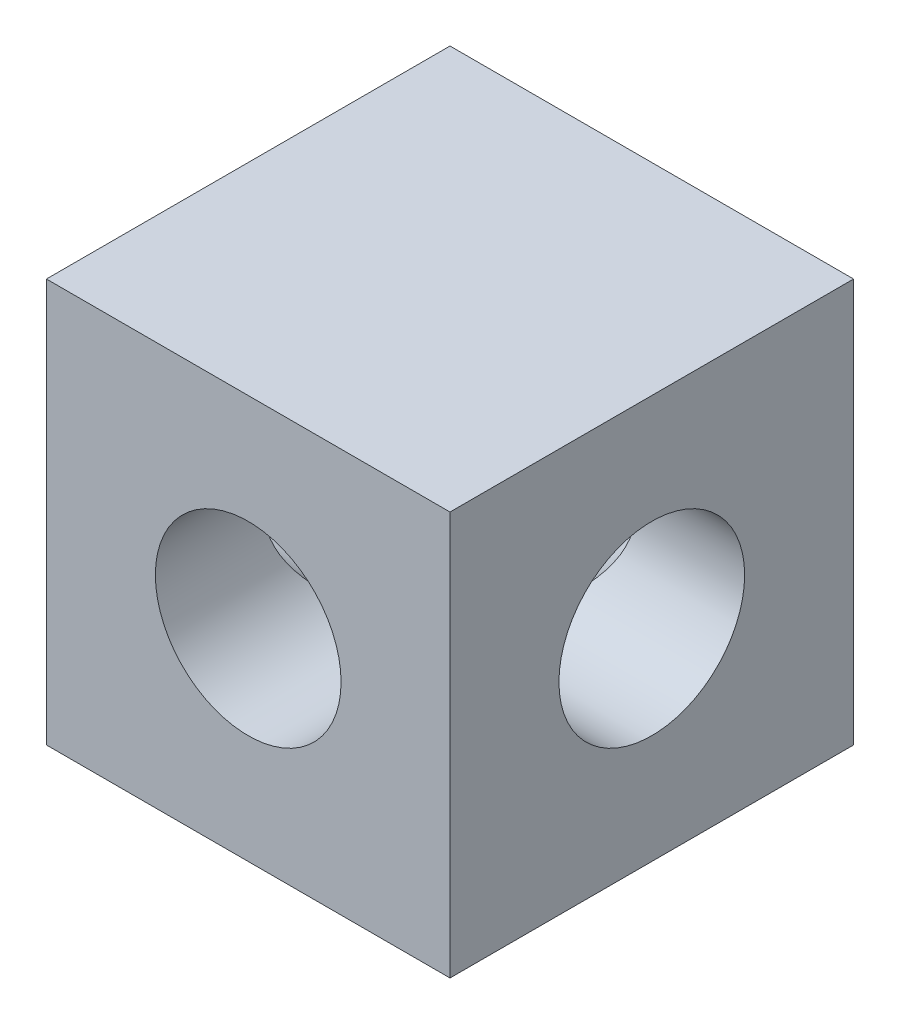
ISO-10303-21;
HEADER;
FILE_DESCRIPTION(('STEP AP214'),'2;1');
FILE_NAME('part.step','',(''),(''),'','','');
FILE_SCHEMA(('AUTOMOTIVE_DESIGN { 1 0 10303 214 1 1 1 1 }'));
ENDSEC;
DATA;
#1=APPLICATION_CONTEXT('core data for automotive mechanical design processes');
#2=APPLICATION_PROTOCOL_DEFINITION('international standard','automotive_design',2000,#1);
#3=PRODUCT_CONTEXT('',#1,'mechanical');
#4=PRODUCT('Part','Part','',(#3));
#5=PRODUCT_RELATED_PRODUCT_CATEGORY('part','',(#4));
#6=PRODUCT_DEFINITION_FORMATION('','',#4);
#7=PRODUCT_DEFINITION_CONTEXT('part definition',#1,'design');
#8=PRODUCT_DEFINITION('design','',#6,#7);
#9=PRODUCT_DEFINITION_SHAPE('','',#8);
#10=(LENGTH_UNIT() NAMED_UNIT(*) SI_UNIT(.MILLI.,.METRE.));
#11=(NAMED_UNIT(*) PLANE_ANGLE_UNIT() SI_UNIT($,.RADIAN.));
#12=(NAMED_UNIT(*) SI_UNIT($,.STERADIAN.) SOLID_ANGLE_UNIT());
#13=UNCERTAINTY_MEASURE_WITH_UNIT(LENGTH_MEASURE(1.E-05),#10,'distance_accuracy_value','');
#14=(GEOMETRIC_REPRESENTATION_CONTEXT(3) GLOBAL_UNCERTAINTY_ASSIGNED_CONTEXT((#13)) GLOBAL_UNIT_ASSIGNED_CONTEXT((#10,
#11,#12)) REPRESENTATION_CONTEXT('',''));
#15=CARTESIAN_POINT('',(0.,0.,0.));
#16=DIRECTION('',(0.,0.,1.));
#17=DIRECTION('',(1.,0.,0.));
#18=AXIS2_PLACEMENT_3D('',#15,#16,#17);
#19=CARTESIAN_POINT('',(0.,10.16,0.060000000000001));
#20=DIRECTION('',(0.,0.,1.));
#21=DIRECTION('',(1.,0.,0.));
#22=AXIS2_PLACEMENT_3D('',#19,#20,#21);
#23=PLANE('',#22);
#24=CARTESIAN_POINT('',(0.,10.16,0.060000000000001));
#25=DIRECTION('',(0.,0.,1.));
#26=DIRECTION('',(1.,0.,0.));
#27=AXIS2_PLACEMENT_3D('',#24,#25,#26);
#28=CIRCLE('',#27,4.675);
#29=CARTESIAN_POINT('',(0.059999999999925,14.8346149574056,0.0600000000000017));
#30=VERTEX_POINT('',#29);
#31=CARTESIAN_POINT('',(-0.0600000000000012,14.8346149574056,0.059999999999993));
#32=VERTEX_POINT('',#31);
#33=EDGE_CURVE('E144',#30,#32,#28,.T.);
#34=ORIENTED_EDGE('',*,*,#33,.T.);
#35=DIRECTION('',(0.,-1.,0.));
#36=VECTOR('',#35,1.);
#37=CARTESIAN_POINT('',(-0.0600000000000012,10.16,0.060000000000001));
#38=LINE('',#37,#36);
#39=CARTESIAN_POINT('',(-0.0600000000000089,5.48538504259442,0.0600000000000008));
#40=VERTEX_POINT('',#39);
#41=EDGE_CURVE('E11',#32,#40,#38,.T.);
#42=ORIENTED_EDGE('',*,*,#41,.T.);
#43=CARTESIAN_POINT('',(0.0600000000000004,5.48538504259442,0.0600000000000252));
#44=VERTEX_POINT('',#43);
#45=EDGE_CURVE('E148',#40,#44,#28,.T.);
#46=ORIENTED_EDGE('',*,*,#45,.T.);
#47=DIRECTION('',(0.,1.,0.));
#48=VECTOR('',#47,1.);
#49=CARTESIAN_POINT('',(0.0600000000000004,10.16,0.060000000000001));
#50=LINE('',#49,#48);
#51=EDGE_CURVE('E41',#44,#30,#50,.T.);
#52=ORIENTED_EDGE('',*,*,#51,.T.);
#53=EDGE_LOOP('',(#34,#42,#46,#52));
#54=FACE_BOUND('',#53,.T.);
#55=ADVANCED_FACE('F33',(#54),#23,.T.);
#56=CARTESIAN_POINT('',(-10.16,20.32,-10.16));
#57=DIRECTION('',(1.,0.,0.));
#58=DIRECTION('',(0.,0.,-1.));
#59=AXIS2_PLACEMENT_3D('',#56,#57,#58);
#60=PLANE('',#59);
#61=CARTESIAN_POINT('',(-10.16,10.16,0.));
#62=DIRECTION('',(-1.,0.,0.));
#63=DIRECTION('',(0.,0.,1.));
#64=AXIS2_PLACEMENT_3D('',#61,#62,#63);
#65=CIRCLE('',#64,4.675);
#66=CARTESIAN_POINT('',(-10.16,10.16,4.67499999999997));
#67=VERTEX_POINT('',#66);
#68=EDGE_CURVE('E128',#67,#67,#65,.T.);
#69=ORIENTED_EDGE('',*,*,#68,.F.);
#70=EDGE_LOOP('',(#69));
#71=FACE_BOUND('',#70,.T.);
#72=DIRECTION('',(0.,0.,1.));
#73=VECTOR('',#72,1.);
#74=CARTESIAN_POINT('',(-10.16,0.,-10.16));
#75=LINE('',#74,#73);
#76=CARTESIAN_POINT('',(-10.16,0.,-10.16));
#77=VERTEX_POINT('',#76);
#78=CARTESIAN_POINT('',(-10.16,0.,10.16));
#79=VERTEX_POINT('',#78);
#80=EDGE_CURVE('E147',#77,#79,#75,.T.);
#81=ORIENTED_EDGE('',*,*,#80,.T.);
#82=DIRECTION('',(0.,-1.,0.));
#83=VECTOR('',#82,1.);
#84=CARTESIAN_POINT('',(-10.16,20.32,10.16));
#85=LINE('',#84,#83);
#86=CARTESIAN_POINT('',(-10.16,20.32,10.16));
#87=VERTEX_POINT('',#86);
#88=EDGE_CURVE('E177',#87,#79,#85,.T.);
#89=ORIENTED_EDGE('',*,*,#88,.F.);
#90=DIRECTION('',(0.,0.,1.));
#91=VECTOR('',#90,1.);
#92=CARTESIAN_POINT('',(-10.16,20.32,-10.16));
#93=LINE('',#92,#91);
#94=CARTESIAN_POINT('',(-10.16,20.32,-10.16));
#95=VERTEX_POINT('',#94);
#96=EDGE_CURVE('E151',#95,#87,#93,.T.);
#97=ORIENTED_EDGE('',*,*,#96,.F.);
#98=DIRECTION('',(0.,-1.,0.));
#99=VECTOR('',#98,1.);
#100=CARTESIAN_POINT('',(-10.16,20.32,-10.16));
#101=LINE('',#100,#99);
#102=EDGE_CURVE('E161',#95,#77,#101,.T.);
#103=ORIENTED_EDGE('',*,*,#102,.T.);
#104=EDGE_LOOP('',(#81,#89,#97,#103));
#105=FACE_BOUND('',#104,.T.);
#106=ADVANCED_FACE('F35',(#71,#105),#60,.F.);
#107=CARTESIAN_POINT('',(10.16,20.32,10.16));
#108=DIRECTION('',(0.,0.,-1.));
#109=DIRECTION('',(-1.,0.,0.));
#110=AXIS2_PLACEMENT_3D('',#107,#108,#109);
#111=PLANE('',#110);
#112=CARTESIAN_POINT('',(0.,10.16,10.16));
#113=DIRECTION('',(0.,0.,1.));
#114=DIRECTION('',(1.,0.,0.));
#115=AXIS2_PLACEMENT_3D('',#112,#113,#114);
#116=CIRCLE('',#115,4.675);
#117=CARTESIAN_POINT('',(4.675,10.16,10.16));
#118=VERTEX_POINT('',#117);
#119=EDGE_CURVE('E143',#118,#118,#116,.T.);
#120=ORIENTED_EDGE('',*,*,#119,.F.);
#121=EDGE_LOOP('',(#120));
#122=FACE_BOUND('',#121,.T.);
#123=DIRECTION('',(1.,0.,0.));
#124=VECTOR('',#123,1.);
#125=CARTESIAN_POINT('',(10.16,0.,10.16));
#126=LINE('',#125,#124);
#127=CARTESIAN_POINT('',(10.16,0.,10.16));
#128=VERTEX_POINT('',#127);
#129=EDGE_CURVE('E164',#79,#128,#126,.T.);
#130=ORIENTED_EDGE('',*,*,#129,.T.);
#131=DIRECTION('',(0.,-1.,0.));
#132=VECTOR('',#131,1.);
#133=CARTESIAN_POINT('',(10.16,20.32,10.16));
#134=LINE('',#133,#132);
#135=CARTESIAN_POINT('',(10.16,20.32,10.16));
#136=VERTEX_POINT('',#135);
#137=EDGE_CURVE('E174',#136,#128,#134,.T.);
#138=ORIENTED_EDGE('',*,*,#137,.F.);
#139=DIRECTION('',(1.,0.,0.));
#140=VECTOR('',#139,1.);
#141=CARTESIAN_POINT('',(10.16,20.32,10.16));
#142=LINE('',#141,#140);
#143=EDGE_CURVE('E154',#87,#136,#142,.T.);
#144=ORIENTED_EDGE('',*,*,#143,.F.);
#145=ORIENTED_EDGE('',*,*,#88,.T.);
#146=EDGE_LOOP('',(#130,#138,#144,#145));
#147=FACE_BOUND('',#146,.T.);
#148=ADVANCED_FACE('F200',(#122,#147),#111,.F.);
#149=CARTESIAN_POINT('',(10.16,20.32,-10.16));
#150=DIRECTION('',(-1.,0.,0.));
#151=DIRECTION('',(0.,0.,1.));
#152=AXIS2_PLACEMENT_3D('',#149,#150,#151);
#153=PLANE('',#152);
#154=CARTESIAN_POINT('',(10.16,10.16,1.05986670338945E-13));
#155=DIRECTION('',(1.,0.,0.));
#156=DIRECTION('',(0.,0.,-1.));
#157=AXIS2_PLACEMENT_3D('',#154,#155,#156);
#158=CIRCLE('',#157,4.675);
#159=CARTESIAN_POINT('',(10.16,10.16,-4.67499999999989));
#160=VERTEX_POINT('',#159);
#161=EDGE_CURVE('E107',#160,#160,#158,.T.);
#162=ORIENTED_EDGE('',*,*,#161,.F.);
#163=EDGE_LOOP('',(#162));
#164=FACE_BOUND('',#163,.T.);
#165=DIRECTION('',(0.,0.,-1.));
#166=VECTOR('',#165,1.);
#167=CARTESIAN_POINT('',(10.16,0.,-10.16));
#168=LINE('',#167,#166);
#169=CARTESIAN_POINT('',(10.16,0.,-10.16));
#170=VERTEX_POINT('',#169);
#171=EDGE_CURVE('E166',#128,#170,#168,.T.);
#172=ORIENTED_EDGE('',*,*,#171,.T.);
#173=DIRECTION('',(0.,-1.,0.));
#174=VECTOR('',#173,1.);
#175=CARTESIAN_POINT('',(10.16,20.32,-10.16));
#176=LINE('',#175,#174);
#177=CARTESIAN_POINT('',(10.16,20.32,-10.16));
#178=VERTEX_POINT('',#177);
#179=EDGE_CURVE('E171',#178,#170,#176,.T.);
#180=ORIENTED_EDGE('',*,*,#179,.F.);
#181=DIRECTION('',(0.,0.,-1.));
#182=VECTOR('',#181,1.);
#183=CARTESIAN_POINT('',(10.16,20.32,-10.16));
#184=LINE('',#183,#182);
#185=EDGE_CURVE('E157',#136,#178,#184,.T.);
#186=ORIENTED_EDGE('',*,*,#185,.F.);
#187=ORIENTED_EDGE('',*,*,#137,.T.);
#188=EDGE_LOOP('',(#172,#180,#186,#187));
#189=FACE_BOUND('',#188,.T.);
#190=ADVANCED_FACE('F196',(#164,#189),#153,.F.);
#191=CARTESIAN_POINT('',(10.16,20.32,-10.16));
#192=DIRECTION('',(0.,0.,1.));
#193=DIRECTION('',(1.,0.,0.));
#194=AXIS2_PLACEMENT_3D('',#191,#192,#193);
#195=PLANE('',#194);
#196=CARTESIAN_POINT('',(0.,10.16,-10.16));
#197=DIRECTION('',(0.,0.,-1.));
#198=DIRECTION('',(-1.,0.,0.));
#199=AXIS2_PLACEMENT_3D('',#196,#197,#198);
#200=CIRCLE('',#199,4.675);
#201=CARTESIAN_POINT('',(-4.675,10.16,-10.16));
#202=VERTEX_POINT('',#201);
#203=EDGE_CURVE('E124',#202,#202,#200,.T.);
#204=ORIENTED_EDGE('',*,*,#203,.F.);
#205=EDGE_LOOP('',(#204));
#206=FACE_BOUND('',#205,.T.);
#207=DIRECTION('',(-1.,0.,0.));
#208=VECTOR('',#207,1.);
#209=CARTESIAN_POINT('',(10.16,0.,-10.16));
#210=LINE('',#209,#208);
#211=EDGE_CURVE('E155',#170,#77,#210,.T.);
#212=ORIENTED_EDGE('',*,*,#211,.T.);
#213=ORIENTED_EDGE('',*,*,#102,.F.);
#214=DIRECTION('',(-1.,0.,0.));
#215=VECTOR('',#214,1.);
#216=CARTESIAN_POINT('',(10.16,20.32,-10.16));
#217=LINE('',#216,#215);
#218=EDGE_CURVE('E159',#178,#95,#217,.T.);
#219=ORIENTED_EDGE('',*,*,#218,.F.);
#220=ORIENTED_EDGE('',*,*,#179,.T.);
#221=EDGE_LOOP('',(#212,#213,#219,#220));
#222=FACE_BOUND('',#221,.T.);
#223=ADVANCED_FACE('F199',(#206,#222),#195,.F.);
#224=CARTESIAN_POINT('',(0.,20.32,0.));
#225=DIRECTION('',(0.,-1.,0.));
#226=DIRECTION('',(0.,0.,-1.));
#227=AXIS2_PLACEMENT_3D('',#224,#225,#226);
#228=PLANE('',#227);
#229=ORIENTED_EDGE('',*,*,#96,.T.);
#230=ORIENTED_EDGE('',*,*,#143,.T.);
#231=ORIENTED_EDGE('',*,*,#185,.T.);
#232=ORIENTED_EDGE('',*,*,#218,.T.);
#233=EDGE_LOOP('',(#229,#230,#231,#232));
#234=FACE_BOUND('',#233,.T.);
#235=ADVANCED_FACE('F217',(#234),#228,.F.);
#236=CARTESIAN_POINT('',(0.,0.,0.));
#237=DIRECTION('',(0.,-1.,0.));
#238=DIRECTION('',(0.,0.,-1.));
#239=AXIS2_PLACEMENT_3D('',#236,#237,#238);
#240=PLANE('',#239);
#241=ORIENTED_EDGE('',*,*,#80,.F.);
#242=ORIENTED_EDGE('',*,*,#211,.F.);
#243=ORIENTED_EDGE('',*,*,#171,.F.);
#244=ORIENTED_EDGE('',*,*,#129,.F.);
#245=EDGE_LOOP('',(#241,#242,#243,#244));
#246=FACE_BOUND('',#245,.T.);
#247=ADVANCED_FACE('F212',(#246),#240,.T.);
#248=CARTESIAN_POINT('',(0.,10.16,0.060000000000001));
#249=DIRECTION('',(0.,0.,1.));
#250=DIRECTION('',(1.,0.,0.));
#251=AXIS2_PLACEMENT_3D('',#248,#249,#250);
#252=CYLINDRICAL_SURFACE('',#251,4.675);
#253=ORIENTED_EDGE('',*,*,#45,.F.);
#254=CARTESIAN_POINT('',(0.,10.16,0.));
#255=DIRECTION('',(0.707106781186546,0.,0.707106781186549));
#256=DIRECTION('',(-0.707106781186549,0.,0.707106781186546));
#257=AXIS2_PLACEMENT_3D('',#254,#255,#256);
#258=ELLIPSE('',#257,6.61144840409421,4.675);
#259=EDGE_CURVE('E140',#40,#32,#258,.F.);
#260=ORIENTED_EDGE('',*,*,#259,.T.);
#261=ORIENTED_EDGE('',*,*,#33,.F.);
#262=CARTESIAN_POINT('',(0.,10.16,0.));
#263=DIRECTION('',(-0.707106781186551,0.,0.707106781186544));
#264=DIRECTION('',(0.707106781186544,0.,0.707106781186551));
#265=AXIS2_PLACEMENT_3D('',#262,#263,#264);
#266=ELLIPSE('',#265,6.61144840409425,4.675);
#267=EDGE_CURVE('E138',#30,#44,#266,.F.);
#268=ORIENTED_EDGE('',*,*,#267,.T.);
#269=EDGE_LOOP('',(#253,#260,#261,#268));
#270=FACE_BOUND('',#269,.T.);
#271=ORIENTED_EDGE('',*,*,#119,.T.);
#272=EDGE_LOOP('',(#271));
#273=FACE_BOUND('',#272,.T.);
#274=ADVANCED_FACE('F184',(#270,#273),#252,.F.);
#275=CARTESIAN_POINT('',(-0.060000000000001,10.16,0.));
#276=DIRECTION('',(-1.,0.,0.));
#277=DIRECTION('',(0.,0.,1.));
#278=AXIS2_PLACEMENT_3D('',#275,#276,#277);
#279=CYLINDRICAL_SURFACE('',#278,4.675);
#280=ORIENTED_EDGE('',*,*,#68,.T.);
#281=EDGE_LOOP('',(#280));
#282=FACE_BOUND('',#281,.T.);
#283=CARTESIAN_POINT('',(-0.060000000000001,10.16,0.));
#284=DIRECTION('',(-1.,0.,0.));
#285=DIRECTION('',(0.,0.,1.));
#286=AXIS2_PLACEMENT_3D('',#283,#284,#285);
#287=CIRCLE('',#286,4.675);
#288=CARTESIAN_POINT('',(-0.0600000000000008,5.48538504259442,-0.060000000000001));
#289=VERTEX_POINT('',#288);
#290=EDGE_CURVE('E48',#289,#40,#287,.T.);
#291=ORIENTED_EDGE('',*,*,#290,.F.);
#292=CARTESIAN_POINT('',(0.,10.16,0.));
#293=DIRECTION('',(-0.707106781186549,0.,0.707106781186546));
#294=DIRECTION('',(-0.707106781186546,0.,-0.707106781186549));
#295=AXIS2_PLACEMENT_3D('',#292,#293,#294);
#296=ELLIPSE('',#295,6.61144840409423,4.675);
#297=CARTESIAN_POINT('',(-0.060000000000001,14.8346149574056,-0.0599999999999244));
#298=VERTEX_POINT('',#297);
#299=EDGE_CURVE('E118',#289,#298,#296,.F.);
#300=ORIENTED_EDGE('',*,*,#299,.T.);
#301=EDGE_CURVE('E134',#32,#298,#287,.T.);
#302=ORIENTED_EDGE('',*,*,#301,.F.);
#303=ORIENTED_EDGE('',*,*,#259,.F.);
#304=EDGE_LOOP('',(#291,#300,#302,#303));
#305=FACE_BOUND('',#304,.T.);
#306=ADVANCED_FACE('F188',(#282,#305),#279,.F.);
#307=CARTESIAN_POINT('',(0.060000000000001,10.16,0.));
#308=DIRECTION('',(1.,0.,0.));
#309=DIRECTION('',(0.,0.,-1.));
#310=AXIS2_PLACEMENT_3D('',#307,#308,#309);
#311=CYLINDRICAL_SURFACE('',#310,4.675);
#312=ORIENTED_EDGE('',*,*,#161,.T.);
#313=EDGE_LOOP('',(#312));
#314=FACE_BOUND('',#313,.T.);
#315=CARTESIAN_POINT('',(0.060000000000001,10.16,0.));
#316=DIRECTION('',(1.,0.,0.));
#317=DIRECTION('',(0.,0.,-1.));
#318=AXIS2_PLACEMENT_3D('',#315,#316,#317);
#319=CIRCLE('',#318,4.675);
#320=CARTESIAN_POINT('',(0.0600000000000017,14.8346149574056,-0.060000000000001));
#321=VERTEX_POINT('',#320);
#322=EDGE_CURVE('E56',#321,#30,#319,.T.);
#323=ORIENTED_EDGE('',*,*,#322,.F.);
#324=CARTESIAN_POINT('',(0.,10.16,0.));
#325=DIRECTION('',(-0.707106781186544,0.,-0.707106781186551));
#326=DIRECTION('',(0.707106781186551,0.,-0.707106781186544));
#327=AXIS2_PLACEMENT_3D('',#324,#325,#326);
#328=ELLIPSE('',#327,6.61144840409418,4.675);
#329=CARTESIAN_POINT('',(0.0600000000000017,5.48538504259442,-0.060000000000001));
#330=VERTEX_POINT('',#329);
#331=EDGE_CURVE('E116',#330,#321,#328,.F.);
#332=ORIENTED_EDGE('',*,*,#331,.F.);
#333=EDGE_CURVE('E97',#44,#330,#319,.T.);
#334=ORIENTED_EDGE('',*,*,#333,.F.);
#335=ORIENTED_EDGE('',*,*,#267,.F.);
#336=EDGE_LOOP('',(#323,#332,#334,#335));
#337=FACE_BOUND('',#336,.T.);
#338=ADVANCED_FACE('F123',(#314,#337),#311,.F.);
#339=CARTESIAN_POINT('',(-0.060000000000001,10.16,0.));
#340=DIRECTION('',(-1.,0.,0.));
#341=DIRECTION('',(0.,0.,1.));
#342=AXIS2_PLACEMENT_3D('',#339,#340,#341);
#343=PLANE('',#342);
#344=ORIENTED_EDGE('',*,*,#301,.T.);
#345=DIRECTION('',(0.,-1.,0.));
#346=VECTOR('',#345,1.);
#347=CARTESIAN_POINT('',(-0.0600000000000008,10.16,-0.060000000000001));
#348=LINE('',#347,#346);
#349=EDGE_CURVE('E133',#298,#289,#348,.T.);
#350=ORIENTED_EDGE('',*,*,#349,.T.);
#351=ORIENTED_EDGE('',*,*,#290,.T.);
#352=ORIENTED_EDGE('',*,*,#41,.F.);
#353=EDGE_LOOP('',(#344,#350,#351,#352));
#354=FACE_BOUND('',#353,.T.);
#355=ADVANCED_FACE('F189',(#354),#343,.T.);
#356=CARTESIAN_POINT('',(0.,10.16,-0.060000000000001));
#357=DIRECTION('',(0.,0.,-1.));
#358=DIRECTION('',(-1.,0.,0.));
#359=AXIS2_PLACEMENT_3D('',#356,#357,#358);
#360=PLANE('',#359);
#361=CARTESIAN_POINT('',(0.,10.16,-0.060000000000001));
#362=DIRECTION('',(0.,0.,-1.));
#363=DIRECTION('',(-1.,0.,0.));
#364=AXIS2_PLACEMENT_3D('',#361,#362,#363);
#365=CIRCLE('',#364,4.675);
#366=EDGE_CURVE('E121',#298,#321,#365,.T.);
#367=ORIENTED_EDGE('',*,*,#366,.T.);
#368=DIRECTION('',(0.,-1.,0.));
#369=VECTOR('',#368,1.);
#370=CARTESIAN_POINT('',(0.0600000000000017,10.16,-0.060000000000001));
#371=LINE('',#370,#369);
#372=EDGE_CURVE('E101',#321,#330,#371,.T.);
#373=ORIENTED_EDGE('',*,*,#372,.T.);
#374=EDGE_CURVE('E112',#330,#289,#365,.T.);
#375=ORIENTED_EDGE('',*,*,#374,.T.);
#376=ORIENTED_EDGE('',*,*,#349,.F.);
#377=EDGE_LOOP('',(#367,#373,#375,#376));
#378=FACE_BOUND('',#377,.T.);
#379=ADVANCED_FACE('F126',(#378),#360,.T.);
#380=CARTESIAN_POINT('',(0.,10.16,-0.060000000000001));
#381=DIRECTION('',(0.,0.,-1.));
#382=DIRECTION('',(-1.,0.,0.));
#383=AXIS2_PLACEMENT_3D('',#380,#381,#382);
#384=CYLINDRICAL_SURFACE('',#383,4.675);
#385=ORIENTED_EDGE('',*,*,#374,.F.);
#386=ORIENTED_EDGE('',*,*,#331,.T.);
#387=ORIENTED_EDGE('',*,*,#366,.F.);
#388=ORIENTED_EDGE('',*,*,#299,.F.);
#389=EDGE_LOOP('',(#385,#386,#387,#388));
#390=FACE_BOUND('',#389,.T.);
#391=ORIENTED_EDGE('',*,*,#203,.T.);
#392=EDGE_LOOP('',(#391));
#393=FACE_BOUND('',#392,.T.);
#394=ADVANCED_FACE('F113',(#390,#393),#384,.F.);
#395=CARTESIAN_POINT('',(0.060000000000001,10.16,0.));
#396=DIRECTION('',(1.,0.,0.));
#397=DIRECTION('',(0.,0.,-1.));
#398=AXIS2_PLACEMENT_3D('',#395,#396,#397);
#399=PLANE('',#398);
#400=ORIENTED_EDGE('',*,*,#333,.T.);
#401=ORIENTED_EDGE('',*,*,#372,.F.);
#402=ORIENTED_EDGE('',*,*,#322,.T.);
#403=ORIENTED_EDGE('',*,*,#51,.F.);
#404=EDGE_LOOP('',(#400,#401,#402,#403));
#405=FACE_BOUND('',#404,.T.);
#406=ADVANCED_FACE('F99',(#405),#399,.T.);
#407=CLOSED_SHELL('',(#55,#106,#148,#190,#223,#235,#247,#274,#306,#338,#355,#379,#394,#406));
#408=MANIFOLD_SOLID_BREP('B2',#407);
#409=ADVANCED_BREP_SHAPE_REPRESENTATION('',(#18,#408),#14);
#410=SHAPE_DEFINITION_REPRESENTATION(#9,#409);
ENDSEC;
END-ISO-10303-21;
